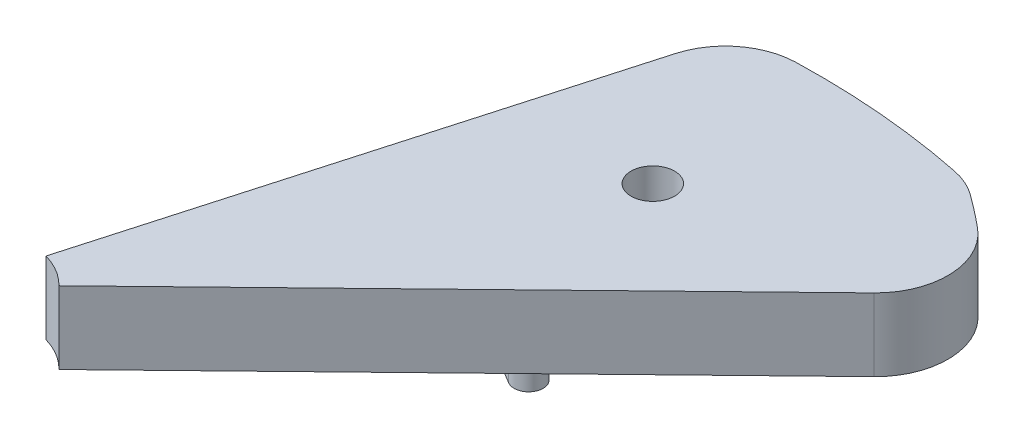
ISO-10303-21;
HEADER;
FILE_DESCRIPTION(('STEP AP214'),'2;1');
FILE_NAME('part.step','',(''),(''),'','','');
FILE_SCHEMA(('AUTOMOTIVE_DESIGN { 1 0 10303 214 1 1 1 1 }'));
ENDSEC;
DATA;
#1=APPLICATION_CONTEXT('core data for automotive mechanical design processes');
#2=APPLICATION_PROTOCOL_DEFINITION('international standard','automotive_design',2000,#1);
#3=PRODUCT_CONTEXT('',#1,'mechanical');
#4=PRODUCT('Part','Part','',(#3));
#5=PRODUCT_RELATED_PRODUCT_CATEGORY('part','',(#4));
#6=PRODUCT_DEFINITION_FORMATION('','',#4);
#7=PRODUCT_DEFINITION_CONTEXT('part definition',#1,'design');
#8=PRODUCT_DEFINITION('design','',#6,#7);
#9=PRODUCT_DEFINITION_SHAPE('','',#8);
#10=(LENGTH_UNIT() NAMED_UNIT(*) SI_UNIT(.MILLI.,.METRE.));
#11=(NAMED_UNIT(*) PLANE_ANGLE_UNIT() SI_UNIT($,.RADIAN.));
#12=(NAMED_UNIT(*) SI_UNIT($,.STERADIAN.) SOLID_ANGLE_UNIT());
#13=UNCERTAINTY_MEASURE_WITH_UNIT(LENGTH_MEASURE(1.E-05),#10,'distance_accuracy_value','');
#14=(GEOMETRIC_REPRESENTATION_CONTEXT(3) GLOBAL_UNCERTAINTY_ASSIGNED_CONTEXT((#13)) GLOBAL_UNIT_ASSIGNED_CONTEXT((#10,
#11,#12)) REPRESENTATION_CONTEXT('',''));
#15=CARTESIAN_POINT('',(0.,0.,0.));
#16=DIRECTION('',(0.,0.,1.));
#17=DIRECTION('',(1.,0.,0.));
#18=AXIS2_PLACEMENT_3D('',#15,#16,#17);
#19=CARTESIAN_POINT('',(0.,0.,0.));
#20=DIRECTION('',(0.,1.,0.));
#21=DIRECTION('',(0.,0.,1.));
#22=AXIS2_PLACEMENT_3D('',#19,#20,#21);
#23=PLANE('',#22);
#24=CARTESIAN_POINT('',(0.,0.,0.));
#25=DIRECTION('',(0.,1.,0.));
#26=DIRECTION('',(0.,0.,1.));
#27=AXIS2_PLACEMENT_3D('',#24,#25,#26);
#28=CIRCLE('',#27,5.);
#29=CARTESIAN_POINT('',(3.17995025359764,0.,-3.85848628151564));
#30=VERTEX_POINT('',#29);
#31=CARTESIAN_POINT('',(2.95670324990526,0.,-4.03210936012402));
#32=VERTEX_POINT('',#31);
#33=EDGE_CURVE('E202',#30,#32,#28,.T.);
#34=ORIENTED_EDGE('',*,*,#33,.F.);
#35=CARTESIAN_POINT('',(2.86195522823788,0.,-3.47263765336407));
#36=DIRECTION('',(0.,1.,0.));
#37=DIRECTION('',(0.,0.,1.));
#38=AXIS2_PLACEMENT_3D('',#35,#36,#37);
#39=CIRCLE('',#38,0.5);
#40=CARTESIAN_POINT('',(3.21008189722987,0.,-3.1137395865867));
#41=VERTEX_POINT('',#40);
#42=EDGE_CURVE('E231',#30,#41,#39,.F.);
#43=ORIENTED_EDGE('',*,*,#42,.T.);
#44=DIRECTION('',(0.717796133554748,0.,-0.696253337983994));
#45=VECTOR('',#44,1.);
#46=CARTESIAN_POINT('',(0.,0.,0.));
#47=LINE('',#46,#45);
#48=CARTESIAN_POINT('',(0.358898066777374,0.,-0.348126668991997));
#49=VERTEX_POINT('',#48);
#50=EDGE_CURVE('E198',#49,#41,#47,.T.);
#51=ORIENTED_EDGE('',*,*,#50,.F.);
#52=CARTESIAN_POINT('',(0.,0.,0.));
#53=DIRECTION('',(0.,1.,0.));
#54=DIRECTION('',(0.,0.,1.));
#55=AXIS2_PLACEMENT_3D('',#52,#53,#54);
#56=CIRCLE('',#55,0.5);
#57=CARTESIAN_POINT('',(0.136751508702332,0.,-0.480935572470613));
#58=VERTEX_POINT('',#57);
#59=EDGE_CURVE('E176',#49,#58,#56,.T.);
#60=ORIENTED_EDGE('',*,*,#59,.T.);
#61=DIRECTION('',(0.273503017404664,0.,-0.961871144941225));
#62=VECTOR('',#61,1.);
#63=CARTESIAN_POINT('',(0.,0.,0.));
#64=LINE('',#63,#62);
#65=CARTESIAN_POINT('',(1.09713347100614,0.,-3.85846210372383));
#66=VERTEX_POINT('',#65);
#67=EDGE_CURVE('E182',#58,#66,#64,.T.);
#68=ORIENTED_EDGE('',*,*,#67,.T.);
#69=CARTESIAN_POINT('',(1.57806904347675,0.,-3.7217105950215));
#70=DIRECTION('',(0.,1.,0.));
#71=DIRECTION('',(0.,0.,1.));
#72=AXIS2_PLACEMENT_3D('',#69,#70,#71);
#73=CIRCLE('',#72,0.5);
#74=CARTESIAN_POINT('',(1.56348507107143,0.,-4.22149785751313));
#75=VERTEX_POINT('',#74);
#76=EDGE_CURVE('E225',#66,#75,#73,.F.);
#77=ORIENTED_EDGE('',*,*,#76,.T.);
#78=CARTESIAN_POINT('',(1.71661678132726,0.,1.02626839864902));
#79=DIRECTION('',(0.,1.,0.));
#80=DIRECTION('',(0.,0.,1.));
#81=AXIS2_PLACEMENT_3D('',#78,#79,#80);
#82=CIRCLE('',#81,5.25);
#83=CARTESIAN_POINT('',(2.76044515055552,0.,-4.11891598440221));
#84=VERTEX_POINT('',#83);
#85=EDGE_CURVE('E214',#84,#75,#82,.T.);
#86=ORIENTED_EDGE('',*,*,#85,.F.);
#87=CARTESIAN_POINT('',(2.66103292491474,0.,-3.62889842411162));
#88=DIRECTION('',(0.,1.,0.));
#89=DIRECTION('',(0.,0.,1.));
#90=AXIS2_PLACEMENT_3D('',#87,#88,#89);
#91=CIRCLE('',#90,0.5);
#92=EDGE_CURVE('E228',#84,#32,#91,.F.);
#93=ORIENTED_EDGE('',*,*,#92,.T.);
#94=EDGE_LOOP('',(#34,#43,#51,#60,#68,#77,#86,#93));
#95=FACE_BOUND('',#94,.T.);
#96=CARTESIAN_POINT('',(1.79596969763579,0.,-3.00407936732271));
#97=DIRECTION('',(0.,1.,0.));
#98=DIRECTION('',(0.,0.,1.));
#99=AXIS2_PLACEMENT_3D('',#96,#97,#98);
#100=CIRCLE('',#99,0.15);
#101=CARTESIAN_POINT('',(1.79596969763579,0.,-2.85407936732271));
#102=VERTEX_POINT('',#101);
#103=EDGE_CURVE('E163',#102,#102,#100,.T.);
#104=ORIENTED_EDGE('',*,*,#103,.T.);
#105=EDGE_LOOP('',(#104));
#106=FACE_BOUND('',#105,.T.);
#107=CARTESIAN_POINT('',(0.981964852810588,0.,-2.61691517398724));
#108=DIRECTION('',(0.,-1.,0.));
#109=DIRECTION('',(0.,0.,-1.));
#110=AXIS2_PLACEMENT_3D('',#107,#108,#109);
#111=CIRCLE('',#110,0.0999999999999996);
#112=CARTESIAN_POINT('',(0.930651432878137,0.,-2.53108433492088));
#113=VERTEX_POINT('',#112);
#114=CARTESIAN_POINT('',(1.03327827274304,0.,-2.70274601305361));
#115=VERTEX_POINT('',#114);
#116=EDGE_CURVE('E156',#113,#115,#111,.T.);
#117=ORIENTED_EDGE('',*,*,#116,.F.);
#118=DIRECTION('',(-0.858308390663632,0.,-0.513134199324511));
#119=VECTOR('',#118,1.);
#120=CARTESIAN_POINT('',(0.930651432878137,0.,-2.53108433492088));
#121=LINE('',#120,#119);
#122=CARTESIAN_POINT('',(1.78895982354177,0.,-2.01795013559637));
#123=VERTEX_POINT('',#122);
#124=EDGE_CURVE('E153',#123,#113,#121,.T.);
#125=ORIENTED_EDGE('',*,*,#124,.F.);
#126=CARTESIAN_POINT('',(1.84027324347422,0.,-2.10378097466273));
#127=DIRECTION('',(0.,-1.,0.));
#128=DIRECTION('',(0.,0.,-1.));
#129=AXIS2_PLACEMENT_3D('',#126,#127,#128);
#130=CIRCLE('',#129,0.0999999999999997);
#131=CARTESIAN_POINT('',(1.89158666340667,0.,-2.18961181372909));
#132=VERTEX_POINT('',#131);
#133=EDGE_CURVE('E65',#132,#123,#130,.T.);
#134=ORIENTED_EDGE('',*,*,#133,.F.);
#135=DIRECTION('',(0.858308390663632,0.,0.51313419932451));
#136=VECTOR('',#135,1.);
#137=CARTESIAN_POINT('',(1.03327827274304,0.,-2.7027460130536));
#138=LINE('',#137,#136);
#139=EDGE_CURVE('E60',#115,#132,#138,.T.);
#140=ORIENTED_EDGE('',*,*,#139,.F.);
#141=EDGE_LOOP('',(#117,#125,#134,#140));
#142=FACE_BOUND('',#141,.T.);
#143=ADVANCED_FACE('F44',(#95,#106,#142),#23,.F.);
#144=CARTESIAN_POINT('',(0.,0.5,0.));
#145=DIRECTION('',(0.,-1.,0.));
#146=DIRECTION('',(0.,0.,-1.));
#147=AXIS2_PLACEMENT_3D('',#144,#145,#146);
#148=CYLINDRICAL_SURFACE('',#147,5.);
#149=CARTESIAN_POINT('',(0.,0.5,0.));
#150=DIRECTION('',(0.,1.,0.));
#151=DIRECTION('',(0.,0.,1.));
#152=AXIS2_PLACEMENT_3D('',#149,#150,#151);
#153=CIRCLE('',#152,5.);
#154=CARTESIAN_POINT('',(3.17995025359764,0.5,-3.85848628151564));
#155=VERTEX_POINT('',#154);
#156=CARTESIAN_POINT('',(2.95670324990526,0.5,-4.03210936012402));
#157=VERTEX_POINT('',#156);
#158=EDGE_CURVE('E186',#155,#157,#153,.T.);
#159=ORIENTED_EDGE('',*,*,#158,.F.);
#160=DIRECTION('',(0.,-1.,0.));
#161=VECTOR('',#160,1.);
#162=CARTESIAN_POINT('',(3.17995025359764,0.5,-3.85848628151564));
#163=LINE('',#162,#161);
#164=EDGE_CURVE('E221',#155,#30,#163,.T.);
#165=ORIENTED_EDGE('',*,*,#164,.T.);
#166=ORIENTED_EDGE('',*,*,#33,.T.);
#167=DIRECTION('',(0.,-1.,0.));
#168=VECTOR('',#167,1.);
#169=CARTESIAN_POINT('',(2.95670324990526,0.5,-4.03210936012402));
#170=LINE('',#169,#168);
#171=EDGE_CURVE('E218',#32,#157,#170,.F.);
#172=ORIENTED_EDGE('',*,*,#171,.T.);
#173=EDGE_LOOP('',(#159,#165,#166,#172));
#174=FACE_BOUND('',#173,.T.);
#175=ADVANCED_FACE('F275',(#174),#148,.T.);
#176=CARTESIAN_POINT('',(0.,0.5,0.));
#177=DIRECTION('',(-0.961871144941225,0.,-0.273503017404664));
#178=DIRECTION('',(-0.273503017404664,0.,0.961871144941225));
#179=AXIS2_PLACEMENT_3D('',#176,#177,#178);
#180=PLANE('',#179);
#181=DIRECTION('',(0.273503017404664,0.,-0.961871144941225));
#182=VECTOR('',#181,1.);
#183=CARTESIAN_POINT('',(0.,0.5,0.));
#184=LINE('',#183,#182);
#185=CARTESIAN_POINT('',(0.136751508702332,0.5,-0.480935572470613));
#186=VERTEX_POINT('',#185);
#187=CARTESIAN_POINT('',(1.09713347100614,0.5,-3.85846210372383));
#188=VERTEX_POINT('',#187);
#189=EDGE_CURVE('E190',#186,#188,#184,.T.);
#190=ORIENTED_EDGE('',*,*,#189,.T.);
#191=DIRECTION('',(0.,1.,0.));
#192=VECTOR('',#191,1.);
#193=CARTESIAN_POINT('',(1.09713347100614,0.5,-3.85846210372383));
#194=LINE('',#193,#192);
#195=EDGE_CURVE('E12',#188,#66,#194,.F.);
#196=ORIENTED_EDGE('',*,*,#195,.T.);
#197=ORIENTED_EDGE('',*,*,#67,.F.);
#198=DIRECTION('',(0.,-1.,0.));
#199=VECTOR('',#198,1.);
#200=CARTESIAN_POINT('',(0.136751508702332,0.5,-0.480935572470613));
#201=LINE('',#200,#199);
#202=EDGE_CURVE('E194',#186,#58,#201,.T.);
#203=ORIENTED_EDGE('',*,*,#202,.F.);
#204=EDGE_LOOP('',(#190,#196,#197,#203));
#205=FACE_BOUND('',#204,.T.);
#206=ADVANCED_FACE('F266',(#205),#180,.T.);
#207=CARTESIAN_POINT('',(0.,0.5,0.));
#208=DIRECTION('',(0.,1.,0.));
#209=DIRECTION('',(0.,0.,1.));
#210=AXIS2_PLACEMENT_3D('',#207,#208,#209);
#211=PLANE('',#210);
#212=CARTESIAN_POINT('',(1.79596969763579,0.5,-3.00407936732271));
#213=DIRECTION('',(0.,1.,0.));
#214=DIRECTION('',(0.,0.,1.));
#215=AXIS2_PLACEMENT_3D('',#212,#213,#214);
#216=CIRCLE('',#215,0.15);
#217=CARTESIAN_POINT('',(1.79596969763579,0.5,-2.85407936732271));
#218=VERTEX_POINT('',#217);
#219=EDGE_CURVE('E172',#218,#218,#216,.F.);
#220=ORIENTED_EDGE('',*,*,#219,.T.);
#221=EDGE_LOOP('',(#220));
#222=FACE_BOUND('',#221,.T.);
#223=DIRECTION('',(0.717796133554748,0.,-0.696253337983994));
#224=VECTOR('',#223,1.);
#225=CARTESIAN_POINT('',(0.,0.5,0.));
#226=LINE('',#225,#224);
#227=CARTESIAN_POINT('',(0.358898066777374,0.5,-0.348126668991997));
#228=VERTEX_POINT('',#227);
#229=CARTESIAN_POINT('',(3.21008189722987,0.5,-3.1137395865867));
#230=VERTEX_POINT('',#229);
#231=EDGE_CURVE('E181',#228,#230,#226,.T.);
#232=ORIENTED_EDGE('',*,*,#231,.T.);
#233=CARTESIAN_POINT('',(2.86195522823788,0.5,-3.47263765336407));
#234=DIRECTION('',(0.,1.,0.));
#235=DIRECTION('',(0.,0.,1.));
#236=AXIS2_PLACEMENT_3D('',#233,#234,#235);
#237=CIRCLE('',#236,0.5);
#238=EDGE_CURVE('E243',#230,#155,#237,.T.);
#239=ORIENTED_EDGE('',*,*,#238,.T.);
#240=ORIENTED_EDGE('',*,*,#158,.T.);
#241=CARTESIAN_POINT('',(2.66103292491474,0.5,-3.62889842411162));
#242=DIRECTION('',(0.,1.,0.));
#243=DIRECTION('',(0.,0.,1.));
#244=AXIS2_PLACEMENT_3D('',#241,#242,#243);
#245=CIRCLE('',#244,0.5);
#246=CARTESIAN_POINT('',(2.76044515055552,0.5,-4.11891598440221));
#247=VERTEX_POINT('',#246);
#248=EDGE_CURVE('E240',#157,#247,#245,.T.);
#249=ORIENTED_EDGE('',*,*,#248,.T.);
#250=CARTESIAN_POINT('',(1.71661678132726,0.5,1.02626839864902));
#251=DIRECTION('',(0.,1.,0.));
#252=DIRECTION('',(0.,0.,1.));
#253=AXIS2_PLACEMENT_3D('',#250,#251,#252);
#254=CIRCLE('',#253,5.25);
#255=CARTESIAN_POINT('',(1.56348507107143,0.5,-4.22149785751313));
#256=VERTEX_POINT('',#255);
#257=EDGE_CURVE('E158',#247,#256,#254,.T.);
#258=ORIENTED_EDGE('',*,*,#257,.T.);
#259=CARTESIAN_POINT('',(1.57806904347675,0.5,-3.7217105950215));
#260=DIRECTION('',(0.,1.,0.));
#261=DIRECTION('',(0.,0.,1.));
#262=AXIS2_PLACEMENT_3D('',#259,#260,#261);
#263=CIRCLE('',#262,0.5);
#264=EDGE_CURVE('E237',#256,#188,#263,.T.);
#265=ORIENTED_EDGE('',*,*,#264,.T.);
#266=ORIENTED_EDGE('',*,*,#189,.F.);
#267=CARTESIAN_POINT('',(0.,0.5,0.));
#268=DIRECTION('',(0.,1.,0.));
#269=DIRECTION('',(0.,0.,1.));
#270=AXIS2_PLACEMENT_3D('',#267,#268,#269);
#271=CIRCLE('',#270,0.5);
#272=EDGE_CURVE('E177',#228,#186,#271,.T.);
#273=ORIENTED_EDGE('',*,*,#272,.F.);
#274=EDGE_LOOP('',(#232,#239,#240,#249,#258,#265,#266,#273));
#275=FACE_BOUND('',#274,.T.);
#276=ADVANCED_FACE('F270',(#222,#275),#211,.T.);
#277=CARTESIAN_POINT('',(0.,0.5,0.));
#278=DIRECTION('',(0.,-1.,0.));
#279=DIRECTION('',(0.,0.,-1.));
#280=AXIS2_PLACEMENT_3D('',#277,#278,#279);
#281=CYLINDRICAL_SURFACE('',#280,0.5);
#282=ORIENTED_EDGE('',*,*,#59,.F.);
#283=DIRECTION('',(0.,-1.,0.));
#284=VECTOR('',#283,1.);
#285=CARTESIAN_POINT('',(0.358898066777374,0.5,-0.348126668991997));
#286=LINE('',#285,#284);
#287=EDGE_CURVE('E211',#228,#49,#286,.T.);
#288=ORIENTED_EDGE('',*,*,#287,.F.);
#289=ORIENTED_EDGE('',*,*,#272,.T.);
#290=ORIENTED_EDGE('',*,*,#202,.T.);
#291=EDGE_LOOP('',(#282,#288,#289,#290));
#292=FACE_BOUND('',#291,.T.);
#293=ADVANCED_FACE('F309',(#292),#281,.F.);
#294=CARTESIAN_POINT('',(0.,0.5,0.));
#295=DIRECTION('',(-0.696253337983994,0.,-0.717796133554748));
#296=DIRECTION('',(-0.717796133554748,0.,0.696253337983994));
#297=AXIS2_PLACEMENT_3D('',#294,#295,#296);
#298=PLANE('',#297);
#299=ORIENTED_EDGE('',*,*,#50,.T.);
#300=DIRECTION('',(0.,-1.,0.));
#301=VECTOR('',#300,1.);
#302=CARTESIAN_POINT('',(3.21008189722987,0.5,-3.1137395865867));
#303=LINE('',#302,#301);
#304=EDGE_CURVE('E234',#41,#230,#303,.F.);
#305=ORIENTED_EDGE('',*,*,#304,.T.);
#306=ORIENTED_EDGE('',*,*,#231,.F.);
#307=ORIENTED_EDGE('',*,*,#287,.T.);
#308=EDGE_LOOP('',(#299,#305,#306,#307));
#309=FACE_BOUND('',#308,.T.);
#310=ADVANCED_FACE('F282',(#309),#298,.F.);
#311=CARTESIAN_POINT('',(1.79596969763579,2.,-3.00407936732271));
#312=DIRECTION('',(0.,-1.,0.));
#313=DIRECTION('',(0.,0.,-1.));
#314=AXIS2_PLACEMENT_3D('',#311,#312,#313);
#315=CYLINDRICAL_SURFACE('',#314,0.15);
#316=ORIENTED_EDGE('',*,*,#219,.F.);
#317=EDGE_LOOP('',(#316));
#318=FACE_BOUND('',#317,.T.);
#319=ORIENTED_EDGE('',*,*,#103,.F.);
#320=EDGE_LOOP('',(#319));
#321=FACE_BOUND('',#320,.T.);
#322=ADVANCED_FACE('F292',(#318,#321),#315,.F.);
#323=CARTESIAN_POINT('',(1.71661678132726,-1.5,1.02626839864902));
#324=DIRECTION('',(0.,1.,0.));
#325=DIRECTION('',(0.,0.,1.));
#326=AXIS2_PLACEMENT_3D('',#323,#324,#325);
#327=CYLINDRICAL_SURFACE('',#326,5.25);
#328=ORIENTED_EDGE('',*,*,#257,.F.);
#329=DIRECTION('',(0.,1.,0.));
#330=VECTOR('',#329,1.);
#331=CARTESIAN_POINT('',(2.76044515055552,-1.5,-4.11891598440221));
#332=LINE('',#331,#330);
#333=EDGE_CURVE('E53',#247,#84,#332,.F.);
#334=ORIENTED_EDGE('',*,*,#333,.T.);
#335=ORIENTED_EDGE('',*,*,#85,.T.);
#336=DIRECTION('',(0.,1.,0.));
#337=VECTOR('',#336,1.);
#338=CARTESIAN_POINT('',(1.56348507107143,-1.5,-4.22149785751313));
#339=LINE('',#338,#337);
#340=EDGE_CURVE('E246',#75,#256,#339,.T.);
#341=ORIENTED_EDGE('',*,*,#340,.T.);
#342=EDGE_LOOP('',(#328,#334,#335,#341));
#343=FACE_BOUND('',#342,.T.);
#344=ADVANCED_FACE('F254',(#343),#327,.T.);
#345=CARTESIAN_POINT('',(2.86195522823788,0.5,-3.47263765336407));
#346=DIRECTION('',(0.,-1.,0.));
#347=DIRECTION('',(0.,0.,-1.));
#348=AXIS2_PLACEMENT_3D('',#345,#346,#347);
#349=CYLINDRICAL_SURFACE('',#348,0.5);
#350=ORIENTED_EDGE('',*,*,#238,.F.);
#351=ORIENTED_EDGE('',*,*,#304,.F.);
#352=ORIENTED_EDGE('',*,*,#42,.F.);
#353=ORIENTED_EDGE('',*,*,#164,.F.);
#354=EDGE_LOOP('',(#350,#351,#352,#353));
#355=FACE_BOUND('',#354,.T.);
#356=ADVANCED_FACE('F285',(#355),#349,.T.);
#357=CARTESIAN_POINT('',(2.66103292491474,0.5,-3.62889842411162));
#358=DIRECTION('',(0.,-1.,0.));
#359=DIRECTION('',(0.,0.,-1.));
#360=AXIS2_PLACEMENT_3D('',#357,#358,#359);
#361=CYLINDRICAL_SURFACE('',#360,0.5);
#362=ORIENTED_EDGE('',*,*,#248,.F.);
#363=ORIENTED_EDGE('',*,*,#171,.F.);
#364=ORIENTED_EDGE('',*,*,#92,.F.);
#365=ORIENTED_EDGE('',*,*,#333,.F.);
#366=EDGE_LOOP('',(#362,#363,#364,#365));
#367=FACE_BOUND('',#366,.T.);
#368=ADVANCED_FACE('F273',(#367),#361,.T.);
#369=CARTESIAN_POINT('',(1.57806904347675,-1.5,-3.7217105950215));
#370=DIRECTION('',(0.,1.,0.));
#371=DIRECTION('',(0.,0.,1.));
#372=AXIS2_PLACEMENT_3D('',#369,#370,#371);
#373=CYLINDRICAL_SURFACE('',#372,0.5);
#374=ORIENTED_EDGE('',*,*,#264,.F.);
#375=ORIENTED_EDGE('',*,*,#340,.F.);
#376=ORIENTED_EDGE('',*,*,#76,.F.);
#377=ORIENTED_EDGE('',*,*,#195,.F.);
#378=EDGE_LOOP('',(#374,#375,#376,#377));
#379=FACE_BOUND('',#378,.T.);
#380=ADVANCED_FACE('F46',(#379),#373,.T.);
#381=CARTESIAN_POINT('',(0.981964852810588,-0.2,-2.61691517398724));
#382=DIRECTION('',(0.,1.,0.));
#383=DIRECTION('',(0.,0.,1.));
#384=AXIS2_PLACEMENT_3D('',#381,#382,#383);
#385=CYLINDRICAL_SURFACE('',#384,0.0999999999999996);
#386=ORIENTED_EDGE('',*,*,#116,.T.);
#387=DIRECTION('',(0.,1.,0.));
#388=VECTOR('',#387,1.);
#389=CARTESIAN_POINT('',(1.03327827274304,-0.2,-2.7027460130536));
#390=LINE('',#389,#388);
#391=CARTESIAN_POINT('',(1.03327827274304,-0.2,-2.7027460130536));
#392=VERTEX_POINT('',#391);
#393=EDGE_CURVE('E135',#392,#115,#390,.T.);
#394=ORIENTED_EDGE('',*,*,#393,.F.);
#395=CARTESIAN_POINT('',(0.981964852810588,-0.2,-2.61691517398724));
#396=DIRECTION('',(0.,-1.,0.));
#397=DIRECTION('',(0.,0.,-1.));
#398=AXIS2_PLACEMENT_3D('',#395,#396,#397);
#399=CIRCLE('',#398,0.0999999999999996);
#400=CARTESIAN_POINT('',(0.930651432878137,-0.2,-2.53108433492088));
#401=VERTEX_POINT('',#400);
#402=EDGE_CURVE('E143',#401,#392,#399,.T.);
#403=ORIENTED_EDGE('',*,*,#402,.F.);
#404=DIRECTION('',(0.,1.,0.));
#405=VECTOR('',#404,1.);
#406=CARTESIAN_POINT('',(0.930651432878137,-0.2,-2.53108433492088));
#407=LINE('',#406,#405);
#408=EDGE_CURVE('E330',#401,#113,#407,.T.);
#409=ORIENTED_EDGE('',*,*,#408,.T.);
#410=EDGE_LOOP('',(#386,#394,#403,#409));
#411=FACE_BOUND('',#410,.T.);
#412=ADVANCED_FACE('F155',(#411),#385,.T.);
#413=CARTESIAN_POINT('',(1.03327827274304,-0.2,-2.7027460130536));
#414=DIRECTION('',(-0.51313419932451,0.,0.858308390663632));
#415=DIRECTION('',(0.858308390663632,0.,0.51313419932451));
#416=AXIS2_PLACEMENT_3D('',#413,#414,#415);
#417=PLANE('',#416);
#418=ORIENTED_EDGE('',*,*,#139,.T.);
#419=DIRECTION('',(0.,1.,0.));
#420=VECTOR('',#419,1.);
#421=CARTESIAN_POINT('',(1.89158666340667,-0.2,-2.18961181372909));
#422=LINE('',#421,#420);
#423=CARTESIAN_POINT('',(1.89158666340667,-0.2,-2.18961181372909));
#424=VERTEX_POINT('',#423);
#425=EDGE_CURVE('E138',#424,#132,#422,.T.);
#426=ORIENTED_EDGE('',*,*,#425,.F.);
#427=DIRECTION('',(0.858308390663632,0.,0.51313419932451));
#428=VECTOR('',#427,1.);
#429=CARTESIAN_POINT('',(1.03327827274304,-0.2,-2.7027460130536));
#430=LINE('',#429,#428);
#431=EDGE_CURVE('E131',#392,#424,#430,.T.);
#432=ORIENTED_EDGE('',*,*,#431,.F.);
#433=ORIENTED_EDGE('',*,*,#393,.T.);
#434=EDGE_LOOP('',(#418,#426,#432,#433));
#435=FACE_BOUND('',#434,.T.);
#436=ADVANCED_FACE('F133',(#435),#417,.F.);
#437=CARTESIAN_POINT('',(1.84027324347422,-0.2,-2.10378097466273));
#438=DIRECTION('',(0.,1.,0.));
#439=DIRECTION('',(0.,0.,1.));
#440=AXIS2_PLACEMENT_3D('',#437,#438,#439);
#441=CYLINDRICAL_SURFACE('',#440,0.0999999999999997);
#442=ORIENTED_EDGE('',*,*,#133,.T.);
#443=DIRECTION('',(0.,1.,0.));
#444=VECTOR('',#443,1.);
#445=CARTESIAN_POINT('',(1.78895982354177,-0.2,-2.01795013559637));
#446=LINE('',#445,#444);
#447=CARTESIAN_POINT('',(1.78895982354177,-0.2,-2.01795013559637));
#448=VERTEX_POINT('',#447);
#449=EDGE_CURVE('E165',#448,#123,#446,.T.);
#450=ORIENTED_EDGE('',*,*,#449,.F.);
#451=CARTESIAN_POINT('',(1.84027324347422,-0.2,-2.10378097466273));
#452=DIRECTION('',(0.,-1.,0.));
#453=DIRECTION('',(0.,0.,-1.));
#454=AXIS2_PLACEMENT_3D('',#451,#452,#453);
#455=CIRCLE('',#454,0.0999999999999997);
#456=EDGE_CURVE('E142',#424,#448,#455,.T.);
#457=ORIENTED_EDGE('',*,*,#456,.F.);
#458=ORIENTED_EDGE('',*,*,#425,.T.);
#459=EDGE_LOOP('',(#442,#450,#457,#458));
#460=FACE_BOUND('',#459,.T.);
#461=ADVANCED_FACE('F346',(#460),#441,.T.);
#462=CARTESIAN_POINT('',(0.930651432878137,-0.2,-2.53108433492088));
#463=DIRECTION('',(0.513134199324511,0.,-0.858308390663632));
#464=DIRECTION('',(-0.858308390663632,0.,-0.513134199324511));
#465=AXIS2_PLACEMENT_3D('',#462,#463,#464);
#466=PLANE('',#465);
#467=ORIENTED_EDGE('',*,*,#124,.T.);
#468=ORIENTED_EDGE('',*,*,#408,.F.);
#469=DIRECTION('',(-0.858308390663632,0.,-0.513134199324511));
#470=VECTOR('',#469,1.);
#471=CARTESIAN_POINT('',(0.930651432878137,-0.2,-2.53108433492088));
#472=LINE('',#471,#470);
#473=EDGE_CURVE('E148',#448,#401,#472,.T.);
#474=ORIENTED_EDGE('',*,*,#473,.F.);
#475=ORIENTED_EDGE('',*,*,#449,.T.);
#476=EDGE_LOOP('',(#467,#468,#474,#475));
#477=FACE_BOUND('',#476,.T.);
#478=ADVANCED_FACE('F329',(#477),#466,.F.);
#479=CARTESIAN_POINT('',(0.981964852810588,-0.2,-2.61691517398724));
#480=DIRECTION('',(0.,-1.,0.));
#481=DIRECTION('',(0.,0.,-1.));
#482=AXIS2_PLACEMENT_3D('',#479,#480,#481);
#483=PLANE('',#482);
#484=ORIENTED_EDGE('',*,*,#402,.T.);
#485=ORIENTED_EDGE('',*,*,#431,.T.);
#486=ORIENTED_EDGE('',*,*,#456,.T.);
#487=ORIENTED_EDGE('',*,*,#473,.T.);
#488=EDGE_LOOP('',(#484,#485,#486,#487));
#489=FACE_BOUND('',#488,.T.);
#490=ADVANCED_FACE('F146',(#489),#483,.T.);
#491=CLOSED_SHELL('',(#143,#175,#206,#276,#293,#310,#322,#344,#356,#368,#380,#412,#436,#461,
#478,#490));
#492=MANIFOLD_SOLID_BREP('B2',#491);
#493=ADVANCED_BREP_SHAPE_REPRESENTATION('',(#18,#492),#14);
#494=SHAPE_DEFINITION_REPRESENTATION(#9,#493);
ENDSEC;
END-ISO-10303-21;
